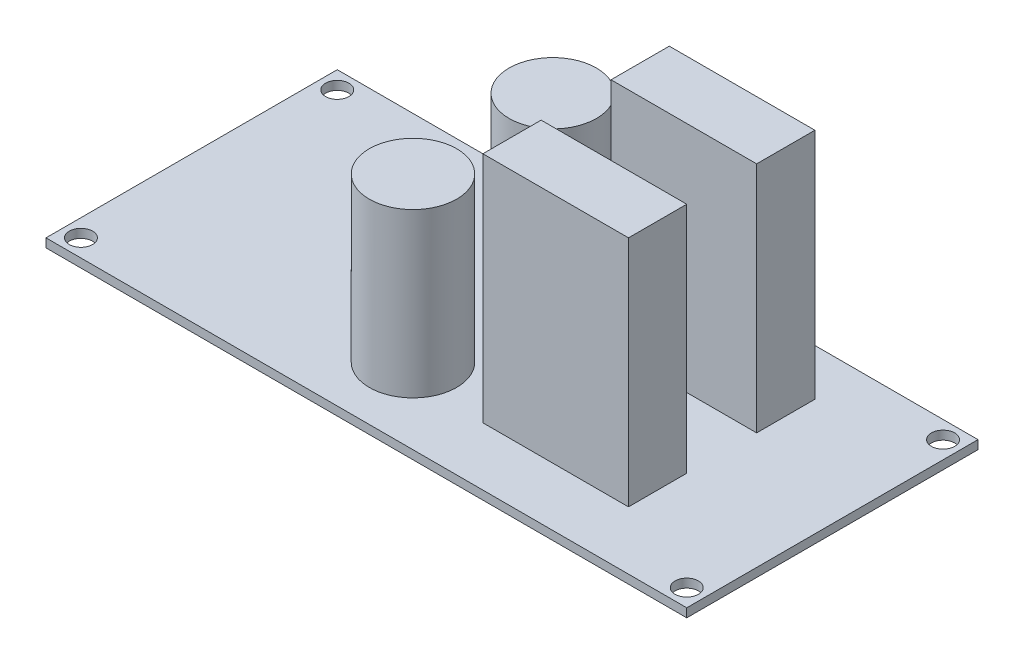
ISO-10303-21;
HEADER;
FILE_DESCRIPTION(('STEP AP214'),'2;1');
FILE_NAME('part.step','',(''),(''),'','','');
FILE_SCHEMA(('AUTOMOTIVE_DESIGN { 1 0 10303 214 1 1 1 1 }'));
ENDSEC;
DATA;
#1=APPLICATION_CONTEXT('core data for automotive mechanical design processes');
#2=APPLICATION_PROTOCOL_DEFINITION('international standard','automotive_design',2000,#1);
#3=PRODUCT_CONTEXT('',#1,'mechanical');
#4=PRODUCT('Part','Part','',(#3));
#5=PRODUCT_RELATED_PRODUCT_CATEGORY('part','',(#4));
#6=PRODUCT_DEFINITION_FORMATION('','',#4);
#7=PRODUCT_DEFINITION_CONTEXT('part definition',#1,'design');
#8=PRODUCT_DEFINITION('design','',#6,#7);
#9=PRODUCT_DEFINITION_SHAPE('','',#8);
#10=(LENGTH_UNIT() NAMED_UNIT(*) SI_UNIT(.MILLI.,.METRE.));
#11=(NAMED_UNIT(*) PLANE_ANGLE_UNIT() SI_UNIT($,.RADIAN.));
#12=(NAMED_UNIT(*) SI_UNIT($,.STERADIAN.) SOLID_ANGLE_UNIT());
#13=UNCERTAINTY_MEASURE_WITH_UNIT(LENGTH_MEASURE(1.E-05),#10,'distance_accuracy_value','');
#14=(GEOMETRIC_REPRESENTATION_CONTEXT(3) GLOBAL_UNCERTAINTY_ASSIGNED_CONTEXT((#13)) GLOBAL_UNIT_ASSIGNED_CONTEXT((#10,
#11,#12)) REPRESENTATION_CONTEXT('',''));
#15=CARTESIAN_POINT('',(0.,0.,0.));
#16=DIRECTION('',(0.,0.,1.));
#17=DIRECTION('',(1.,0.,0.));
#18=AXIS2_PLACEMENT_3D('',#15,#16,#17);
#19=CARTESIAN_POINT('',(50.,41.5,-37.));
#20=DIRECTION('',(0.,-1.,0.));
#21=DIRECTION('',(0.,0.,-1.));
#22=AXIS2_PLACEMENT_3D('',#19,#20,#21);
#23=CYLINDRICAL_SURFACE('',#22,7.5);
#24=CARTESIAN_POINT('',(50.,1.5,-37.));
#25=DIRECTION('',(0.,-1.,0.));
#26=DIRECTION('',(0.,0.,-1.));
#27=AXIS2_PLACEMENT_3D('',#24,#25,#26);
#28=CIRCLE('',#27,7.5);
#29=CARTESIAN_POINT('',(50.,1.5,-44.5));
#30=VERTEX_POINT('',#29);
#31=EDGE_CURVE('E42',#30,#30,#28,.F.);
#32=ORIENTED_EDGE('',*,*,#31,.T.);
#33=EDGE_LOOP('',(#32));
#34=FACE_BOUND('',#33,.T.);
#35=CARTESIAN_POINT('',(50.,29.5,-37.));
#36=DIRECTION('',(0.,1.,0.));
#37=DIRECTION('',(0.,0.,1.));
#38=AXIS2_PLACEMENT_3D('',#35,#36,#37);
#39=CIRCLE('',#38,7.5);
#40=CARTESIAN_POINT('',(50.,29.5,-29.5));
#41=VERTEX_POINT('',#40);
#42=EDGE_CURVE('E258',#41,#41,#39,.T.);
#43=ORIENTED_EDGE('',*,*,#42,.F.);
#44=EDGE_LOOP('',(#43));
#45=FACE_BOUND('',#44,.T.);
#46=ADVANCED_FACE('F33',(#34,#45),#23,.T.);
#47=CARTESIAN_POINT('',(50.,41.5,-13.));
#48=DIRECTION('',(0.,-1.,0.));
#49=DIRECTION('',(0.,0.,-1.));
#50=AXIS2_PLACEMENT_3D('',#47,#48,#49);
#51=CYLINDRICAL_SURFACE('',#50,7.5);
#52=CARTESIAN_POINT('',(50.,1.5,-13.));
#53=DIRECTION('',(0.,-1.,0.));
#54=DIRECTION('',(0.,0.,-1.));
#55=AXIS2_PLACEMENT_3D('',#52,#53,#54);
#56=CIRCLE('',#55,7.5);
#57=CARTESIAN_POINT('',(50.,1.5,-20.5));
#58=VERTEX_POINT('',#57);
#59=EDGE_CURVE('E11',#58,#58,#56,.F.);
#60=ORIENTED_EDGE('',*,*,#59,.T.);
#61=EDGE_LOOP('',(#60));
#62=FACE_BOUND('',#61,.T.);
#63=CARTESIAN_POINT('',(50.,29.5,-13.));
#64=DIRECTION('',(0.,1.,0.));
#65=DIRECTION('',(0.,0.,1.));
#66=AXIS2_PLACEMENT_3D('',#63,#64,#65);
#67=CIRCLE('',#66,7.5);
#68=CARTESIAN_POINT('',(50.,29.5,-5.5));
#69=VERTEX_POINT('',#68);
#70=EDGE_CURVE('E37',#69,#69,#67,.T.);
#71=ORIENTED_EDGE('',*,*,#70,.F.);
#72=EDGE_LOOP('',(#71));
#73=FACE_BOUND('',#72,.T.);
#74=ADVANCED_FACE('F244',(#62,#73),#51,.T.);
#75=CARTESIAN_POINT('',(0.,1.5,0.));
#76=DIRECTION('',(0.,-1.,0.));
#77=DIRECTION('',(0.,0.,-1.));
#78=AXIS2_PLACEMENT_3D('',#75,#76,#77);
#79=PLANE('',#78);
#80=DIRECTION('',(0.,0.,-1.));
#81=VECTOR('',#80,1.);
#82=CARTESIAN_POINT('',(90.,1.5,-42.));
#83=LINE('',#82,#81);
#84=CARTESIAN_POINT('',(90.,1.5,-32.));
#85=VERTEX_POINT('',#84);
#86=CARTESIAN_POINT('',(90.,1.5,-42.));
#87=VERTEX_POINT('',#86);
#88=EDGE_CURVE('E144',#85,#87,#83,.T.);
#89=ORIENTED_EDGE('',*,*,#88,.F.);
#90=DIRECTION('',(1.,0.,0.));
#91=VECTOR('',#90,1.);
#92=CARTESIAN_POINT('',(90.,1.5,-32.));
#93=LINE('',#92,#91);
#94=CARTESIAN_POINT('',(65.,1.5,-32.));
#95=VERTEX_POINT('',#94);
#96=EDGE_CURVE('E157',#95,#85,#93,.T.);
#97=ORIENTED_EDGE('',*,*,#96,.F.);
#98=DIRECTION('',(0.,0.,1.));
#99=VECTOR('',#98,1.);
#100=CARTESIAN_POINT('',(65.,1.5,-42.));
#101=LINE('',#100,#99);
#102=CARTESIAN_POINT('',(65.,1.5,-42.));
#103=VERTEX_POINT('',#102);
#104=EDGE_CURVE('E166',#103,#95,#101,.T.);
#105=ORIENTED_EDGE('',*,*,#104,.F.);
#106=DIRECTION('',(-1.,0.,0.));
#107=VECTOR('',#106,1.);
#108=CARTESIAN_POINT('',(90.,1.5,-42.));
#109=LINE('',#108,#107);
#110=EDGE_CURVE('E147',#87,#103,#109,.T.);
#111=ORIENTED_EDGE('',*,*,#110,.F.);
#112=EDGE_LOOP('',(#89,#97,#105,#111));
#113=FACE_BOUND('',#112,.T.);
#114=ORIENTED_EDGE('',*,*,#59,.F.);
#115=EDGE_LOOP('',(#114));
#116=FACE_BOUND('',#115,.T.);
#117=ORIENTED_EDGE('',*,*,#31,.F.);
#118=EDGE_LOOP('',(#117));
#119=FACE_BOUND('',#118,.T.);
#120=CARTESIAN_POINT('',(107.,1.5,-47.));
#121=DIRECTION('',(0.,1.,0.));
#122=DIRECTION('',(0.,0.,1.));
#123=AXIS2_PLACEMENT_3D('',#120,#121,#122);
#124=CIRCLE('',#123,2.);
#125=CARTESIAN_POINT('',(107.,1.5,-45.));
#126=VERTEX_POINT('',#125);
#127=EDGE_CURVE('E193',#126,#126,#124,.T.);
#128=ORIENTED_EDGE('',*,*,#127,.F.);
#129=EDGE_LOOP('',(#128));
#130=FACE_BOUND('',#129,.T.);
#131=CARTESIAN_POINT('',(3.,1.5,-3.));
#132=DIRECTION('',(0.,1.,0.));
#133=DIRECTION('',(0.,0.,1.));
#134=AXIS2_PLACEMENT_3D('',#131,#132,#133);
#135=CIRCLE('',#134,2.);
#136=CARTESIAN_POINT('',(3.,1.5,-1.));
#137=VERTEX_POINT('',#136);
#138=EDGE_CURVE('E186',#137,#137,#135,.T.);
#139=ORIENTED_EDGE('',*,*,#138,.F.);
#140=EDGE_LOOP('',(#139));
#141=FACE_BOUND('',#140,.T.);
#142=CARTESIAN_POINT('',(3.,1.5,-47.));
#143=DIRECTION('',(0.,1.,0.));
#144=DIRECTION('',(0.,0.,1.));
#145=AXIS2_PLACEMENT_3D('',#142,#143,#144);
#146=CIRCLE('',#145,2.);
#147=CARTESIAN_POINT('',(3.,1.5,-45.));
#148=VERTEX_POINT('',#147);
#149=EDGE_CURVE('E182',#148,#148,#146,.T.);
#150=ORIENTED_EDGE('',*,*,#149,.F.);
#151=EDGE_LOOP('',(#150));
#152=FACE_BOUND('',#151,.T.);
#153=CARTESIAN_POINT('',(107.,1.5,-3.));
#154=DIRECTION('',(0.,1.,0.));
#155=DIRECTION('',(0.,0.,1.));
#156=AXIS2_PLACEMENT_3D('',#153,#154,#155);
#157=CIRCLE('',#156,2.);
#158=CARTESIAN_POINT('',(107.,1.5,-1.));
#159=VERTEX_POINT('',#158);
#160=EDGE_CURVE('E192',#159,#159,#157,.T.);
#161=ORIENTED_EDGE('',*,*,#160,.F.);
#162=EDGE_LOOP('',(#161));
#163=FACE_BOUND('',#162,.T.);
#164=DIRECTION('',(0.,0.,1.));
#165=VECTOR('',#164,1.);
#166=CARTESIAN_POINT('',(0.,1.5,0.));
#167=LINE('',#166,#165);
#168=CARTESIAN_POINT('',(0.,1.5,-50.));
#169=VERTEX_POINT('',#168);
#170=CARTESIAN_POINT('',(0.,1.5,0.));
#171=VERTEX_POINT('',#170);
#172=EDGE_CURVE('E207',#169,#171,#167,.T.);
#173=ORIENTED_EDGE('',*,*,#172,.T.);
#174=DIRECTION('',(1.,0.,0.));
#175=VECTOR('',#174,1.);
#176=CARTESIAN_POINT('',(0.,1.5,0.));
#177=LINE('',#176,#175);
#178=CARTESIAN_POINT('',(110.,1.5,0.));
#179=VERTEX_POINT('',#178);
#180=EDGE_CURVE('E210',#171,#179,#177,.T.);
#181=ORIENTED_EDGE('',*,*,#180,.T.);
#182=DIRECTION('',(0.,0.,-1.));
#183=VECTOR('',#182,1.);
#184=CARTESIAN_POINT('',(110.,1.5,0.));
#185=LINE('',#184,#183);
#186=CARTESIAN_POINT('',(110.,1.5,-50.));
#187=VERTEX_POINT('',#186);
#188=EDGE_CURVE('E213',#179,#187,#185,.T.);
#189=ORIENTED_EDGE('',*,*,#188,.T.);
#190=DIRECTION('',(-1.,0.,0.));
#191=VECTOR('',#190,1.);
#192=CARTESIAN_POINT('',(0.,1.5,-50.));
#193=LINE('',#192,#191);
#194=EDGE_CURVE('E215',#187,#169,#193,.T.);
#195=ORIENTED_EDGE('',*,*,#194,.T.);
#196=EDGE_LOOP('',(#173,#181,#189,#195));
#197=FACE_BOUND('',#196,.T.);
#198=DIRECTION('',(0.,0.,-1.));
#199=VECTOR('',#198,1.);
#200=CARTESIAN_POINT('',(90.,1.5,-20.));
#201=LINE('',#200,#199);
#202=CARTESIAN_POINT('',(90.,1.5,-10.));
#203=VERTEX_POINT('',#202);
#204=CARTESIAN_POINT('',(90.,1.5,-20.));
#205=VERTEX_POINT('',#204);
#206=EDGE_CURVE('E143',#203,#205,#201,.T.);
#207=ORIENTED_EDGE('',*,*,#206,.F.);
#208=DIRECTION('',(1.,0.,0.));
#209=VECTOR('',#208,1.);
#210=CARTESIAN_POINT('',(90.,1.5,-10.));
#211=LINE('',#210,#209);
#212=CARTESIAN_POINT('',(65.,1.5,-10.));
#213=VERTEX_POINT('',#212);
#214=EDGE_CURVE('E140',#213,#203,#211,.T.);
#215=ORIENTED_EDGE('',*,*,#214,.F.);
#216=DIRECTION('',(0.,0.,1.));
#217=VECTOR('',#216,1.);
#218=CARTESIAN_POINT('',(65.,1.5,-20.));
#219=LINE('',#218,#217);
#220=CARTESIAN_POINT('',(65.,1.5,-20.));
#221=VERTEX_POINT('',#220);
#222=EDGE_CURVE('E54',#221,#213,#219,.T.);
#223=ORIENTED_EDGE('',*,*,#222,.F.);
#224=DIRECTION('',(-1.,0.,0.));
#225=VECTOR('',#224,1.);
#226=CARTESIAN_POINT('',(90.,1.5,-20.));
#227=LINE('',#226,#225);
#228=EDGE_CURVE('E49',#205,#221,#227,.T.);
#229=ORIENTED_EDGE('',*,*,#228,.F.);
#230=EDGE_LOOP('',(#207,#215,#223,#229));
#231=FACE_BOUND('',#230,.T.);
#232=ADVANCED_FACE('F241',(#113,#116,#119,#130,#141,#152,#163,#197,#231),#79,.F.);
#233=CARTESIAN_POINT('',(0.,1.5,0.));
#234=DIRECTION('',(1.,0.,0.));
#235=DIRECTION('',(0.,0.,-1.));
#236=AXIS2_PLACEMENT_3D('',#233,#234,#235);
#237=PLANE('',#236);
#238=DIRECTION('',(0.,0.,1.));
#239=VECTOR('',#238,1.);
#240=CARTESIAN_POINT('',(0.,0.,0.));
#241=LINE('',#240,#239);
#242=CARTESIAN_POINT('',(0.,0.,-50.));
#243=VERTEX_POINT('',#242);
#244=CARTESIAN_POINT('',(0.,0.,0.));
#245=VERTEX_POINT('',#244);
#246=EDGE_CURVE('E204',#243,#245,#241,.T.);
#247=ORIENTED_EDGE('',*,*,#246,.T.);
#248=DIRECTION('',(0.,-1.,0.));
#249=VECTOR('',#248,1.);
#250=CARTESIAN_POINT('',(0.,1.5,0.));
#251=LINE('',#250,#249);
#252=EDGE_CURVE('E233',#171,#245,#251,.T.);
#253=ORIENTED_EDGE('',*,*,#252,.F.);
#254=ORIENTED_EDGE('',*,*,#172,.F.);
#255=DIRECTION('',(0.,-1.,0.));
#256=VECTOR('',#255,1.);
#257=CARTESIAN_POINT('',(0.,1.5,-50.));
#258=LINE('',#257,#256);
#259=EDGE_CURVE('E217',#169,#243,#258,.T.);
#260=ORIENTED_EDGE('',*,*,#259,.T.);
#261=EDGE_LOOP('',(#247,#253,#254,#260));
#262=FACE_BOUND('',#261,.T.);
#263=ADVANCED_FACE('F35',(#262),#237,.F.);
#264=CARTESIAN_POINT('',(0.,1.5,0.));
#265=DIRECTION('',(0.,0.,-1.));
#266=DIRECTION('',(-1.,0.,0.));
#267=AXIS2_PLACEMENT_3D('',#264,#265,#266);
#268=PLANE('',#267);
#269=DIRECTION('',(1.,0.,0.));
#270=VECTOR('',#269,1.);
#271=CARTESIAN_POINT('',(0.,0.,0.));
#272=LINE('',#271,#270);
#273=CARTESIAN_POINT('',(110.,0.,0.));
#274=VERTEX_POINT('',#273);
#275=EDGE_CURVE('E220',#245,#274,#272,.T.);
#276=ORIENTED_EDGE('',*,*,#275,.T.);
#277=DIRECTION('',(0.,-1.,0.));
#278=VECTOR('',#277,1.);
#279=CARTESIAN_POINT('',(110.,1.5,0.));
#280=LINE('',#279,#278);
#281=EDGE_CURVE('E230',#179,#274,#280,.T.);
#282=ORIENTED_EDGE('',*,*,#281,.F.);
#283=ORIENTED_EDGE('',*,*,#180,.F.);
#284=ORIENTED_EDGE('',*,*,#252,.T.);
#285=EDGE_LOOP('',(#276,#282,#283,#284));
#286=FACE_BOUND('',#285,.T.);
#287=ADVANCED_FACE('F317',(#286),#268,.F.);
#288=CARTESIAN_POINT('',(110.,1.5,0.));
#289=DIRECTION('',(-1.,0.,0.));
#290=DIRECTION('',(0.,0.,1.));
#291=AXIS2_PLACEMENT_3D('',#288,#289,#290);
#292=PLANE('',#291);
#293=DIRECTION('',(0.,0.,-1.));
#294=VECTOR('',#293,1.);
#295=CARTESIAN_POINT('',(110.,0.,0.));
#296=LINE('',#295,#294);
#297=CARTESIAN_POINT('',(110.,0.,-50.));
#298=VERTEX_POINT('',#297);
#299=EDGE_CURVE('E222',#274,#298,#296,.T.);
#300=ORIENTED_EDGE('',*,*,#299,.T.);
#301=DIRECTION('',(0.,-1.,0.));
#302=VECTOR('',#301,1.);
#303=CARTESIAN_POINT('',(110.,1.5,-50.));
#304=LINE('',#303,#302);
#305=EDGE_CURVE('E227',#187,#298,#304,.T.);
#306=ORIENTED_EDGE('',*,*,#305,.F.);
#307=ORIENTED_EDGE('',*,*,#188,.F.);
#308=ORIENTED_EDGE('',*,*,#281,.T.);
#309=EDGE_LOOP('',(#300,#306,#307,#308));
#310=FACE_BOUND('',#309,.T.);
#311=ADVANCED_FACE('F314',(#310),#292,.F.);
#312=CARTESIAN_POINT('',(0.,1.5,-50.));
#313=DIRECTION('',(0.,0.,1.));
#314=DIRECTION('',(1.,0.,0.));
#315=AXIS2_PLACEMENT_3D('',#312,#313,#314);
#316=PLANE('',#315);
#317=DIRECTION('',(-1.,0.,0.));
#318=VECTOR('',#317,1.);
#319=CARTESIAN_POINT('',(0.,0.,-50.));
#320=LINE('',#319,#318);
#321=EDGE_CURVE('E211',#298,#243,#320,.T.);
#322=ORIENTED_EDGE('',*,*,#321,.T.);
#323=ORIENTED_EDGE('',*,*,#259,.F.);
#324=ORIENTED_EDGE('',*,*,#194,.F.);
#325=ORIENTED_EDGE('',*,*,#305,.T.);
#326=EDGE_LOOP('',(#322,#323,#324,#325));
#327=FACE_BOUND('',#326,.T.);
#328=ADVANCED_FACE('F310',(#327),#316,.F.);
#329=CARTESIAN_POINT('',(0.,0.,0.));
#330=DIRECTION('',(0.,-1.,0.));
#331=DIRECTION('',(0.,0.,-1.));
#332=AXIS2_PLACEMENT_3D('',#329,#330,#331);
#333=PLANE('',#332);
#334=CARTESIAN_POINT('',(107.,0.,-47.));
#335=DIRECTION('',(0.,1.,0.));
#336=DIRECTION('',(0.,0.,1.));
#337=AXIS2_PLACEMENT_3D('',#334,#335,#336);
#338=CIRCLE('',#337,2.);
#339=CARTESIAN_POINT('',(107.,0.,-45.));
#340=VERTEX_POINT('',#339);
#341=EDGE_CURVE('E189',#340,#340,#338,.T.);
#342=ORIENTED_EDGE('',*,*,#341,.T.);
#343=EDGE_LOOP('',(#342));
#344=FACE_BOUND('',#343,.T.);
#345=CARTESIAN_POINT('',(3.,0.,-3.));
#346=DIRECTION('',(0.,1.,0.));
#347=DIRECTION('',(0.,0.,1.));
#348=AXIS2_PLACEMENT_3D('',#345,#346,#347);
#349=CIRCLE('',#348,2.);
#350=CARTESIAN_POINT('',(3.,0.,-1.));
#351=VERTEX_POINT('',#350);
#352=EDGE_CURVE('E196',#351,#351,#349,.T.);
#353=ORIENTED_EDGE('',*,*,#352,.T.);
#354=EDGE_LOOP('',(#353));
#355=FACE_BOUND('',#354,.T.);
#356=CARTESIAN_POINT('',(3.,0.,-47.));
#357=DIRECTION('',(0.,1.,0.));
#358=DIRECTION('',(0.,0.,1.));
#359=AXIS2_PLACEMENT_3D('',#356,#357,#358);
#360=CIRCLE('',#359,2.);
#361=CARTESIAN_POINT('',(3.,0.,-45.));
#362=VERTEX_POINT('',#361);
#363=EDGE_CURVE('E183',#362,#362,#360,.T.);
#364=ORIENTED_EDGE('',*,*,#363,.T.);
#365=EDGE_LOOP('',(#364));
#366=FACE_BOUND('',#365,.T.);
#367=CARTESIAN_POINT('',(107.,0.,-3.));
#368=DIRECTION('',(0.,1.,0.));
#369=DIRECTION('',(0.,0.,1.));
#370=AXIS2_PLACEMENT_3D('',#367,#368,#369);
#371=CIRCLE('',#370,2.);
#372=CARTESIAN_POINT('',(107.,0.,-1.));
#373=VERTEX_POINT('',#372);
#374=EDGE_CURVE('E201',#373,#373,#371,.T.);
#375=ORIENTED_EDGE('',*,*,#374,.T.);
#376=EDGE_LOOP('',(#375));
#377=FACE_BOUND('',#376,.T.);
#378=ORIENTED_EDGE('',*,*,#246,.F.);
#379=ORIENTED_EDGE('',*,*,#321,.F.);
#380=ORIENTED_EDGE('',*,*,#299,.F.);
#381=ORIENTED_EDGE('',*,*,#275,.F.);
#382=EDGE_LOOP('',(#378,#379,#380,#381));
#383=FACE_BOUND('',#382,.T.);
#384=ADVANCED_FACE('F305',(#344,#355,#366,#377,#383),#333,.T.);
#385=CARTESIAN_POINT('',(107.,0.,-3.));
#386=DIRECTION('',(0.,1.,0.));
#387=DIRECTION('',(0.,0.,1.));
#388=AXIS2_PLACEMENT_3D('',#385,#386,#387);
#389=CYLINDRICAL_SURFACE('',#388,2.);
#390=ORIENTED_EDGE('',*,*,#374,.F.);
#391=EDGE_LOOP('',(#390));
#392=FACE_BOUND('',#391,.T.);
#393=ORIENTED_EDGE('',*,*,#160,.T.);
#394=EDGE_LOOP('',(#393));
#395=FACE_BOUND('',#394,.T.);
#396=ADVANCED_FACE('F295',(#392,#395),#389,.F.);
#397=CARTESIAN_POINT('',(3.,0.,-47.));
#398=DIRECTION('',(0.,1.,0.));
#399=DIRECTION('',(0.,0.,1.));
#400=AXIS2_PLACEMENT_3D('',#397,#398,#399);
#401=CYLINDRICAL_SURFACE('',#400,2.);
#402=ORIENTED_EDGE('',*,*,#363,.F.);
#403=EDGE_LOOP('',(#402));
#404=FACE_BOUND('',#403,.T.);
#405=ORIENTED_EDGE('',*,*,#149,.T.);
#406=EDGE_LOOP('',(#405));
#407=FACE_BOUND('',#406,.T.);
#408=ADVANCED_FACE('F291',(#404,#407),#401,.F.);
#409=CARTESIAN_POINT('',(3.,0.,-3.));
#410=DIRECTION('',(0.,1.,0.));
#411=DIRECTION('',(0.,0.,1.));
#412=AXIS2_PLACEMENT_3D('',#409,#410,#411);
#413=CYLINDRICAL_SURFACE('',#412,2.);
#414=ORIENTED_EDGE('',*,*,#352,.F.);
#415=EDGE_LOOP('',(#414));
#416=FACE_BOUND('',#415,.T.);
#417=ORIENTED_EDGE('',*,*,#138,.T.);
#418=EDGE_LOOP('',(#417));
#419=FACE_BOUND('',#418,.T.);
#420=ADVANCED_FACE('F294',(#416,#419),#413,.F.);
#421=CARTESIAN_POINT('',(107.,0.,-47.));
#422=DIRECTION('',(0.,1.,0.));
#423=DIRECTION('',(0.,0.,1.));
#424=AXIS2_PLACEMENT_3D('',#421,#422,#423);
#425=CYLINDRICAL_SURFACE('',#424,2.);
#426=ORIENTED_EDGE('',*,*,#341,.F.);
#427=EDGE_LOOP('',(#426));
#428=FACE_BOUND('',#427,.T.);
#429=ORIENTED_EDGE('',*,*,#127,.T.);
#430=EDGE_LOOP('',(#429));
#431=FACE_BOUND('',#430,.T.);
#432=ADVANCED_FACE('F297',(#428,#431),#425,.F.);
#433=CARTESIAN_POINT('',(90.,41.5,-42.));
#434=DIRECTION('',(-1.,0.,0.));
#435=DIRECTION('',(0.,0.,1.));
#436=AXIS2_PLACEMENT_3D('',#433,#434,#435);
#437=PLANE('',#436);
#438=ORIENTED_EDGE('',*,*,#88,.T.);
#439=DIRECTION('',(0.,-1.,0.));
#440=VECTOR('',#439,1.);
#441=CARTESIAN_POINT('',(90.,41.5,-42.));
#442=LINE('',#441,#440);
#443=CARTESIAN_POINT('',(90.,41.5,-42.));
#444=VERTEX_POINT('',#443);
#445=EDGE_CURVE('E179',#444,#87,#442,.T.);
#446=ORIENTED_EDGE('',*,*,#445,.F.);
#447=DIRECTION('',(0.,0.,-1.));
#448=VECTOR('',#447,1.);
#449=CARTESIAN_POINT('',(90.,41.5,-42.));
#450=LINE('',#449,#448);
#451=CARTESIAN_POINT('',(90.,41.5,-32.));
#452=VERTEX_POINT('',#451);
#453=EDGE_CURVE('E153',#452,#444,#450,.T.);
#454=ORIENTED_EDGE('',*,*,#453,.F.);
#455=DIRECTION('',(0.,-1.,0.));
#456=VECTOR('',#455,1.);
#457=CARTESIAN_POINT('',(90.,41.5,-32.));
#458=LINE('',#457,#456);
#459=EDGE_CURVE('E162',#452,#85,#458,.T.);
#460=ORIENTED_EDGE('',*,*,#459,.T.);
#461=EDGE_LOOP('',(#438,#446,#454,#460));
#462=FACE_BOUND('',#461,.T.);
#463=ADVANCED_FACE('F288',(#462),#437,.F.);
#464=CARTESIAN_POINT('',(90.,41.5,-42.));
#465=DIRECTION('',(0.,0.,1.));
#466=DIRECTION('',(1.,0.,0.));
#467=AXIS2_PLACEMENT_3D('',#464,#465,#466);
#468=PLANE('',#467);
#469=ORIENTED_EDGE('',*,*,#110,.T.);
#470=DIRECTION('',(0.,-1.,0.));
#471=VECTOR('',#470,1.);
#472=CARTESIAN_POINT('',(65.,41.5,-42.));
#473=LINE('',#472,#471);
#474=CARTESIAN_POINT('',(65.,41.5,-42.));
#475=VERTEX_POINT('',#474);
#476=EDGE_CURVE('E176',#475,#103,#473,.T.);
#477=ORIENTED_EDGE('',*,*,#476,.F.);
#478=DIRECTION('',(-1.,0.,0.));
#479=VECTOR('',#478,1.);
#480=CARTESIAN_POINT('',(90.,41.5,-42.));
#481=LINE('',#480,#479);
#482=EDGE_CURVE('E156',#444,#475,#481,.T.);
#483=ORIENTED_EDGE('',*,*,#482,.F.);
#484=ORIENTED_EDGE('',*,*,#445,.T.);
#485=EDGE_LOOP('',(#469,#477,#483,#484));
#486=FACE_BOUND('',#485,.T.);
#487=ADVANCED_FACE('F353',(#486),#468,.F.);
#488=CARTESIAN_POINT('',(65.,41.5,-42.));
#489=DIRECTION('',(1.,0.,0.));
#490=DIRECTION('',(0.,0.,-1.));
#491=AXIS2_PLACEMENT_3D('',#488,#489,#490);
#492=PLANE('',#491);
#493=ORIENTED_EDGE('',*,*,#104,.T.);
#494=DIRECTION('',(0.,-1.,0.));
#495=VECTOR('',#494,1.);
#496=CARTESIAN_POINT('',(65.,41.5,-32.));
#497=LINE('',#496,#495);
#498=CARTESIAN_POINT('',(65.,41.5,-32.));
#499=VERTEX_POINT('',#498);
#500=EDGE_CURVE('E173',#499,#95,#497,.T.);
#501=ORIENTED_EDGE('',*,*,#500,.F.);
#502=DIRECTION('',(0.,0.,1.));
#503=VECTOR('',#502,1.);
#504=CARTESIAN_POINT('',(65.,41.5,-42.));
#505=LINE('',#504,#503);
#506=EDGE_CURVE('E159',#475,#499,#505,.T.);
#507=ORIENTED_EDGE('',*,*,#506,.F.);
#508=ORIENTED_EDGE('',*,*,#476,.T.);
#509=EDGE_LOOP('',(#493,#501,#507,#508));
#510=FACE_BOUND('',#509,.T.);
#511=ADVANCED_FACE('F362',(#510),#492,.F.);
#512=CARTESIAN_POINT('',(90.,41.5,-32.));
#513=DIRECTION('',(0.,0.,-1.));
#514=DIRECTION('',(-1.,0.,0.));
#515=AXIS2_PLACEMENT_3D('',#512,#513,#514);
#516=PLANE('',#515);
#517=ORIENTED_EDGE('',*,*,#96,.T.);
#518=ORIENTED_EDGE('',*,*,#459,.F.);
#519=DIRECTION('',(1.,0.,0.));
#520=VECTOR('',#519,1.);
#521=CARTESIAN_POINT('',(90.,41.5,-32.));
#522=LINE('',#521,#520);
#523=EDGE_CURVE('E161',#499,#452,#522,.T.);
#524=ORIENTED_EDGE('',*,*,#523,.F.);
#525=ORIENTED_EDGE('',*,*,#500,.T.);
#526=EDGE_LOOP('',(#517,#518,#524,#525));
#527=FACE_BOUND('',#526,.T.);
#528=ADVANCED_FACE('F371',(#527),#516,.F.);
#529=CARTESIAN_POINT('',(0.,41.5,0.));
#530=DIRECTION('',(0.,-1.,0.));
#531=DIRECTION('',(0.,0.,-1.));
#532=AXIS2_PLACEMENT_3D('',#529,#530,#531);
#533=PLANE('',#532);
#534=ORIENTED_EDGE('',*,*,#453,.T.);
#535=ORIENTED_EDGE('',*,*,#482,.T.);
#536=ORIENTED_EDGE('',*,*,#506,.T.);
#537=ORIENTED_EDGE('',*,*,#523,.T.);
#538=EDGE_LOOP('',(#534,#535,#536,#537));
#539=FACE_BOUND('',#538,.T.);
#540=ADVANCED_FACE('F381',(#539),#533,.F.);
#541=CARTESIAN_POINT('',(90.,41.5,-20.));
#542=DIRECTION('',(-1.,0.,0.));
#543=DIRECTION('',(0.,0.,1.));
#544=AXIS2_PLACEMENT_3D('',#541,#542,#543);
#545=PLANE('',#544);
#546=ORIENTED_EDGE('',*,*,#206,.T.);
#547=DIRECTION('',(0.,-1.,0.));
#548=VECTOR('',#547,1.);
#549=CARTESIAN_POINT('',(90.,41.5,-20.));
#550=LINE('',#549,#548);
#551=CARTESIAN_POINT('',(90.,41.5,-20.));
#552=VERTEX_POINT('',#551);
#553=EDGE_CURVE('E124',#552,#205,#550,.T.);
#554=ORIENTED_EDGE('',*,*,#553,.F.);
#555=DIRECTION('',(0.,0.,-1.));
#556=VECTOR('',#555,1.);
#557=CARTESIAN_POINT('',(90.,41.5,-20.));
#558=LINE('',#557,#556);
#559=CARTESIAN_POINT('',(90.,41.5,-10.));
#560=VERTEX_POINT('',#559);
#561=EDGE_CURVE('E131',#560,#552,#558,.T.);
#562=ORIENTED_EDGE('',*,*,#561,.F.);
#563=DIRECTION('',(0.,-1.,0.));
#564=VECTOR('',#563,1.);
#565=CARTESIAN_POINT('',(90.,41.5,-10.));
#566=LINE('',#565,#564);
#567=EDGE_CURVE('E263',#560,#203,#566,.T.);
#568=ORIENTED_EDGE('',*,*,#567,.T.);
#569=EDGE_LOOP('',(#546,#554,#562,#568));
#570=FACE_BOUND('',#569,.T.);
#571=ADVANCED_FACE('F142',(#570),#545,.F.);
#572=CARTESIAN_POINT('',(90.,41.5,-20.));
#573=DIRECTION('',(0.,0.,1.));
#574=DIRECTION('',(1.,0.,0.));
#575=AXIS2_PLACEMENT_3D('',#572,#573,#574);
#576=PLANE('',#575);
#577=ORIENTED_EDGE('',*,*,#228,.T.);
#578=DIRECTION('',(0.,-1.,0.));
#579=VECTOR('',#578,1.);
#580=CARTESIAN_POINT('',(65.,41.5,-20.));
#581=LINE('',#580,#579);
#582=CARTESIAN_POINT('',(65.,41.5,-20.));
#583=VERTEX_POINT('',#582);
#584=EDGE_CURVE('E127',#583,#221,#581,.T.);
#585=ORIENTED_EDGE('',*,*,#584,.F.);
#586=DIRECTION('',(-1.,0.,0.));
#587=VECTOR('',#586,1.);
#588=CARTESIAN_POINT('',(90.,41.5,-20.));
#589=LINE('',#588,#587);
#590=EDGE_CURVE('E120',#552,#583,#589,.T.);
#591=ORIENTED_EDGE('',*,*,#590,.F.);
#592=ORIENTED_EDGE('',*,*,#553,.T.);
#593=EDGE_LOOP('',(#577,#585,#591,#592));
#594=FACE_BOUND('',#593,.T.);
#595=ADVANCED_FACE('F122',(#594),#576,.F.);
#596=CARTESIAN_POINT('',(65.,41.5,-20.));
#597=DIRECTION('',(1.,0.,0.));
#598=DIRECTION('',(0.,0.,-1.));
#599=AXIS2_PLACEMENT_3D('',#596,#597,#598);
#600=PLANE('',#599);
#601=ORIENTED_EDGE('',*,*,#222,.T.);
#602=DIRECTION('',(0.,-1.,0.));
#603=VECTOR('',#602,1.);
#604=CARTESIAN_POINT('',(65.,41.5,-10.));
#605=LINE('',#604,#603);
#606=CARTESIAN_POINT('',(65.,41.5,-10.));
#607=VERTEX_POINT('',#606);
#608=EDGE_CURVE('E149',#607,#213,#605,.T.);
#609=ORIENTED_EDGE('',*,*,#608,.F.);
#610=DIRECTION('',(0.,0.,1.));
#611=VECTOR('',#610,1.);
#612=CARTESIAN_POINT('',(65.,41.5,-20.));
#613=LINE('',#612,#611);
#614=EDGE_CURVE('E130',#583,#607,#613,.T.);
#615=ORIENTED_EDGE('',*,*,#614,.F.);
#616=ORIENTED_EDGE('',*,*,#584,.T.);
#617=EDGE_LOOP('',(#601,#609,#615,#616));
#618=FACE_BOUND('',#617,.T.);
#619=ADVANCED_FACE('F408',(#618),#600,.F.);
#620=CARTESIAN_POINT('',(90.,41.5,-10.));
#621=DIRECTION('',(0.,0.,-1.));
#622=DIRECTION('',(-1.,0.,0.));
#623=AXIS2_PLACEMENT_3D('',#620,#621,#622);
#624=PLANE('',#623);
#625=ORIENTED_EDGE('',*,*,#214,.T.);
#626=ORIENTED_EDGE('',*,*,#567,.F.);
#627=DIRECTION('',(1.,0.,0.));
#628=VECTOR('',#627,1.);
#629=CARTESIAN_POINT('',(90.,41.5,-10.));
#630=LINE('',#629,#628);
#631=EDGE_CURVE('E136',#607,#560,#630,.T.);
#632=ORIENTED_EDGE('',*,*,#631,.F.);
#633=ORIENTED_EDGE('',*,*,#608,.T.);
#634=EDGE_LOOP('',(#625,#626,#632,#633));
#635=FACE_BOUND('',#634,.T.);
#636=ADVANCED_FACE('F262',(#635),#624,.F.);
#637=CARTESIAN_POINT('',(0.,41.5,0.));
#638=DIRECTION('',(0.,-1.,0.));
#639=DIRECTION('',(0.,0.,-1.));
#640=AXIS2_PLACEMENT_3D('',#637,#638,#639);
#641=PLANE('',#640);
#642=ORIENTED_EDGE('',*,*,#561,.T.);
#643=ORIENTED_EDGE('',*,*,#590,.T.);
#644=ORIENTED_EDGE('',*,*,#614,.T.);
#645=ORIENTED_EDGE('',*,*,#631,.T.);
#646=EDGE_LOOP('',(#642,#643,#644,#645));
#647=FACE_BOUND('',#646,.T.);
#648=ADVANCED_FACE('F134',(#647),#641,.F.);
#649=CARTESIAN_POINT('',(60.,29.5,-44.5));
#650=DIRECTION('',(0.,1.,0.));
#651=DIRECTION('',(0.,0.,1.));
#652=AXIS2_PLACEMENT_3D('',#649,#650,#651);
#653=PLANE('',#652);
#654=ORIENTED_EDGE('',*,*,#70,.T.);
#655=EDGE_LOOP('',(#654));
#656=FACE_BOUND('',#655,.T.);
#657=ADVANCED_FACE('F278',(#656),#653,.T.);
#658=ORIENTED_EDGE('',*,*,#42,.T.);
#659=EDGE_LOOP('',(#658));
#660=FACE_BOUND('',#659,.T.);
#661=ADVANCED_FACE('F452',(#660),#653,.T.);
#662=CLOSED_SHELL('',(#46,#74,#232,#263,#287,#311,#328,#384,#396,#408,#420,#432,#463,#487,#511,
#528,#540,#571,#595,#619,#636,#648,#657,#661));
#663=MANIFOLD_SOLID_BREP('B2',#662);
#664=ADVANCED_BREP_SHAPE_REPRESENTATION('',(#18,#663),#14);
#665=SHAPE_DEFINITION_REPRESENTATION(#9,#664);
ENDSEC;
END-ISO-10303-21;
